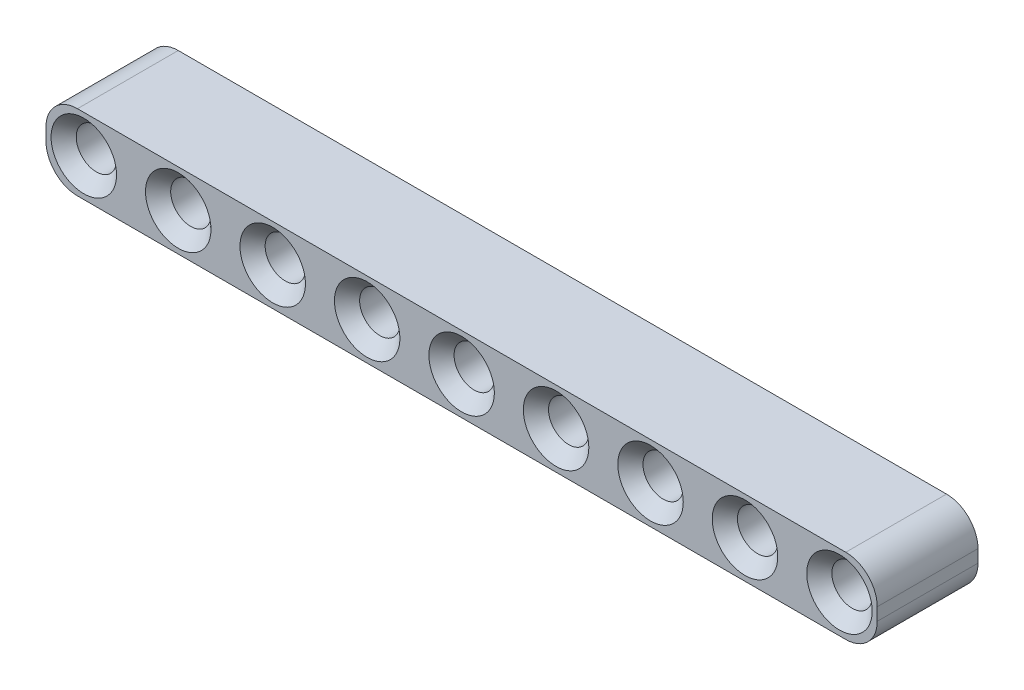
ISO-10303-21;
HEADER;
FILE_DESCRIPTION(('STEP AP214'),'2;1');
FILE_NAME('part.step','',(''),(''),'','','');
FILE_SCHEMA(('AUTOMOTIVE_DESIGN { 1 0 10303 214 1 1 1 1 }'));
ENDSEC;
DATA;
#1=APPLICATION_CONTEXT('core data for automotive mechanical design processes');
#2=APPLICATION_PROTOCOL_DEFINITION('international standard','automotive_design',2000,#1);
#3=PRODUCT_CONTEXT('',#1,'mechanical');
#4=PRODUCT('Part','Part','',(#3));
#5=PRODUCT_RELATED_PRODUCT_CATEGORY('part','',(#4));
#6=PRODUCT_DEFINITION_FORMATION('','',#4);
#7=PRODUCT_DEFINITION_CONTEXT('part definition',#1,'design');
#8=PRODUCT_DEFINITION('design','',#6,#7);
#9=PRODUCT_DEFINITION_SHAPE('','',#8);
#10=(LENGTH_UNIT() NAMED_UNIT(*) SI_UNIT(.MILLI.,.METRE.));
#11=(NAMED_UNIT(*) PLANE_ANGLE_UNIT() SI_UNIT($,.RADIAN.));
#12=(NAMED_UNIT(*) SI_UNIT($,.STERADIAN.) SOLID_ANGLE_UNIT());
#13=UNCERTAINTY_MEASURE_WITH_UNIT(LENGTH_MEASURE(1.E-05),#10,'distance_accuracy_value','');
#14=(GEOMETRIC_REPRESENTATION_CONTEXT(3) GLOBAL_UNCERTAINTY_ASSIGNED_CONTEXT((#13)) GLOBAL_UNIT_ASSIGNED_CONTEXT((#10,
#11,#12)) REPRESENTATION_CONTEXT('',''));
#15=CARTESIAN_POINT('',(0.,0.,0.));
#16=DIRECTION('',(0.,0.,1.));
#17=DIRECTION('',(1.,0.,0.));
#18=AXIS2_PLACEMENT_3D('',#15,#16,#17);
#19=CARTESIAN_POINT('',(60.5,-0.5,8.));
#20=DIRECTION('',(0.,0.,1.));
#21=DIRECTION('',(1.,0.,0.));
#22=AXIS2_PLACEMENT_3D('',#19,#20,#21);
#23=PLANE('',#22);
#24=CARTESIAN_POINT('',(60.,0.,8.));
#25=DIRECTION('',(0.,0.,1.));
#26=DIRECTION('',(1.,0.,0.));
#27=AXIS2_PLACEMENT_3D('',#24,#25,#26);
#28=CIRCLE('',#27,2.60000000000002);
#29=CARTESIAN_POINT('',(62.6,0.,8.));
#30=VERTEX_POINT('',#29);
#31=EDGE_CURVE('E216',#30,#30,#28,.F.);
#32=ORIENTED_EDGE('',*,*,#31,.T.);
#33=EDGE_LOOP('',(#32));
#34=FACE_BOUND('',#33,.T.);
#35=CARTESIAN_POINT('',(52.5,0.,8.));
#36=DIRECTION('',(0.,0.,1.));
#37=DIRECTION('',(1.,0.,0.));
#38=AXIS2_PLACEMENT_3D('',#35,#36,#37);
#39=CIRCLE('',#38,2.6);
#40=CARTESIAN_POINT('',(55.1,0.,8.));
#41=VERTEX_POINT('',#40);
#42=EDGE_CURVE('E213',#41,#41,#39,.F.);
#43=ORIENTED_EDGE('',*,*,#42,.T.);
#44=EDGE_LOOP('',(#43));
#45=FACE_BOUND('',#44,.T.);
#46=CARTESIAN_POINT('',(45.,0.,8.));
#47=DIRECTION('',(0.,0.,1.));
#48=DIRECTION('',(1.,0.,0.));
#49=AXIS2_PLACEMENT_3D('',#46,#47,#48);
#50=CIRCLE('',#49,2.6);
#51=CARTESIAN_POINT('',(47.6,0.,8.));
#52=VERTEX_POINT('',#51);
#53=EDGE_CURVE('E210',#52,#52,#50,.F.);
#54=ORIENTED_EDGE('',*,*,#53,.T.);
#55=EDGE_LOOP('',(#54));
#56=FACE_BOUND('',#55,.T.);
#57=CARTESIAN_POINT('',(37.5,0.,8.));
#58=DIRECTION('',(0.,0.,1.));
#59=DIRECTION('',(1.,0.,0.));
#60=AXIS2_PLACEMENT_3D('',#57,#58,#59);
#61=CIRCLE('',#60,2.6);
#62=CARTESIAN_POINT('',(40.1,0.,8.));
#63=VERTEX_POINT('',#62);
#64=EDGE_CURVE('E207',#63,#63,#61,.F.);
#65=ORIENTED_EDGE('',*,*,#64,.T.);
#66=EDGE_LOOP('',(#65));
#67=FACE_BOUND('',#66,.T.);
#68=CARTESIAN_POINT('',(30.,0.,8.));
#69=DIRECTION('',(0.,0.,1.));
#70=DIRECTION('',(1.,0.,0.));
#71=AXIS2_PLACEMENT_3D('',#68,#69,#70);
#72=CIRCLE('',#71,2.6);
#73=CARTESIAN_POINT('',(32.6,0.,8.));
#74=VERTEX_POINT('',#73);
#75=EDGE_CURVE('E204',#74,#74,#72,.F.);
#76=ORIENTED_EDGE('',*,*,#75,.T.);
#77=EDGE_LOOP('',(#76));
#78=FACE_BOUND('',#77,.T.);
#79=CARTESIAN_POINT('',(22.5,0.,8.));
#80=DIRECTION('',(0.,0.,1.));
#81=DIRECTION('',(1.,0.,0.));
#82=AXIS2_PLACEMENT_3D('',#79,#80,#81);
#83=CIRCLE('',#82,2.6);
#84=CARTESIAN_POINT('',(25.1,0.,8.));
#85=VERTEX_POINT('',#84);
#86=EDGE_CURVE('E201',#85,#85,#83,.F.);
#87=ORIENTED_EDGE('',*,*,#86,.T.);
#88=EDGE_LOOP('',(#87));
#89=FACE_BOUND('',#88,.T.);
#90=CARTESIAN_POINT('',(15.,0.,8.));
#91=DIRECTION('',(0.,0.,1.));
#92=DIRECTION('',(1.,0.,0.));
#93=AXIS2_PLACEMENT_3D('',#90,#91,#92);
#94=CIRCLE('',#93,2.6);
#95=CARTESIAN_POINT('',(17.6,0.,8.));
#96=VERTEX_POINT('',#95);
#97=EDGE_CURVE('E198',#96,#96,#94,.F.);
#98=ORIENTED_EDGE('',*,*,#97,.T.);
#99=EDGE_LOOP('',(#98));
#100=FACE_BOUND('',#99,.T.);
#101=CARTESIAN_POINT('',(7.5,0.,8.));
#102=DIRECTION('',(0.,0.,1.));
#103=DIRECTION('',(1.,0.,0.));
#104=AXIS2_PLACEMENT_3D('',#101,#102,#103);
#105=CIRCLE('',#104,2.60000000000002);
#106=CARTESIAN_POINT('',(10.1,0.,8.));
#107=VERTEX_POINT('',#106);
#108=EDGE_CURVE('E195',#107,#107,#105,.F.);
#109=ORIENTED_EDGE('',*,*,#108,.T.);
#110=EDGE_LOOP('',(#109));
#111=FACE_BOUND('',#110,.T.);
#112=CARTESIAN_POINT('',(0.,0.,8.));
#113=DIRECTION('',(0.,0.,1.));
#114=DIRECTION('',(1.,0.,0.));
#115=AXIS2_PLACEMENT_3D('',#112,#113,#114);
#116=CIRCLE('',#115,2.6);
#117=CARTESIAN_POINT('',(2.6,0.,8.));
#118=VERTEX_POINT('',#117);
#119=EDGE_CURVE('E192',#118,#118,#116,.F.);
#120=ORIENTED_EDGE('',*,*,#119,.T.);
#121=EDGE_LOOP('',(#120));
#122=FACE_BOUND('',#121,.T.);
#123=CARTESIAN_POINT('',(60.5,-0.5,8.));
#124=DIRECTION('',(0.,0.,1.));
#125=DIRECTION('',(1.,0.,0.));
#126=AXIS2_PLACEMENT_3D('',#123,#124,#125);
#127=CIRCLE('',#126,2.5);
#128=CARTESIAN_POINT('',(60.5,-3.,8.));
#129=VERTEX_POINT('',#128);
#130=CARTESIAN_POINT('',(63.,-0.5,8.));
#131=VERTEX_POINT('',#130);
#132=EDGE_CURVE('E144',#129,#131,#127,.T.);
#133=ORIENTED_EDGE('',*,*,#132,.T.);
#134=DIRECTION('',(0.,1.,0.));
#135=VECTOR('',#134,1.);
#136=CARTESIAN_POINT('',(63.,0.5,8.));
#137=LINE('',#136,#135);
#138=CARTESIAN_POINT('',(63.,0.5,8.));
#139=VERTEX_POINT('',#138);
#140=EDGE_CURVE('E94',#131,#139,#137,.T.);
#141=ORIENTED_EDGE('',*,*,#140,.T.);
#142=CARTESIAN_POINT('',(60.5,0.5,8.));
#143=DIRECTION('',(0.,0.,1.));
#144=DIRECTION('',(-1.,0.,0.));
#145=AXIS2_PLACEMENT_3D('',#142,#143,#144);
#146=CIRCLE('',#145,2.5);
#147=CARTESIAN_POINT('',(60.5,3.,8.));
#148=VERTEX_POINT('',#147);
#149=EDGE_CURVE('E446',#139,#148,#146,.T.);
#150=ORIENTED_EDGE('',*,*,#149,.T.);
#151=DIRECTION('',(-1.,0.,0.));
#152=VECTOR('',#151,1.);
#153=CARTESIAN_POINT('',(-0.5,3.,8.));
#154=LINE('',#153,#152);
#155=CARTESIAN_POINT('',(-0.5,3.,8.));
#156=VERTEX_POINT('',#155);
#157=EDGE_CURVE('E450',#148,#156,#154,.T.);
#158=ORIENTED_EDGE('',*,*,#157,.T.);
#159=CARTESIAN_POINT('',(-0.5,0.5,8.));
#160=DIRECTION('',(0.,0.,1.));
#161=DIRECTION('',(1.,0.,0.));
#162=AXIS2_PLACEMENT_3D('',#159,#160,#161);
#163=CIRCLE('',#162,2.5);
#164=CARTESIAN_POINT('',(-3.,0.5,8.));
#165=VERTEX_POINT('',#164);
#166=EDGE_CURVE('E112',#156,#165,#163,.T.);
#167=ORIENTED_EDGE('',*,*,#166,.T.);
#168=DIRECTION('',(0.,-1.,0.));
#169=VECTOR('',#168,1.);
#170=CARTESIAN_POINT('',(-3.,0.5,8.));
#171=LINE('',#170,#169);
#172=CARTESIAN_POINT('',(-3.,-0.5,8.));
#173=VERTEX_POINT('',#172);
#174=EDGE_CURVE('E107',#165,#173,#171,.T.);
#175=ORIENTED_EDGE('',*,*,#174,.T.);
#176=CARTESIAN_POINT('',(-0.5,-0.5,8.));
#177=DIRECTION('',(0.,0.,1.));
#178=DIRECTION('',(1.,0.,0.));
#179=AXIS2_PLACEMENT_3D('',#176,#177,#178);
#180=CIRCLE('',#179,2.5);
#181=CARTESIAN_POINT('',(-0.5,-3.,8.));
#182=VERTEX_POINT('',#181);
#183=EDGE_CURVE('E110',#173,#182,#180,.T.);
#184=ORIENTED_EDGE('',*,*,#183,.T.);
#185=DIRECTION('',(1.,0.,0.));
#186=VECTOR('',#185,1.);
#187=CARTESIAN_POINT('',(-0.5,-3.,8.));
#188=LINE('',#187,#186);
#189=EDGE_CURVE('E50',#182,#129,#188,.T.);
#190=ORIENTED_EDGE('',*,*,#189,.T.);
#191=EDGE_LOOP('',(#133,#141,#150,#158,#167,#175,#184,#190));
#192=FACE_BOUND('',#191,.T.);
#193=ADVANCED_FACE('F33',(#34,#45,#56,#67,#78,#89,#100,#111,#122,#192),#23,.T.);
#194=CARTESIAN_POINT('',(60.5,-0.5,0.));
#195=DIRECTION('',(0.,0.,1.));
#196=DIRECTION('',(1.,0.,0.));
#197=AXIS2_PLACEMENT_3D('',#194,#195,#196);
#198=PLANE('',#197);
#199=CARTESIAN_POINT('',(60.,0.,0.));
#200=DIRECTION('',(0.,0.,1.));
#201=DIRECTION('',(1.,0.,0.));
#202=AXIS2_PLACEMENT_3D('',#199,#200,#201);
#203=CIRCLE('',#202,2.6);
#204=CARTESIAN_POINT('',(62.6,0.,0.));
#205=VERTEX_POINT('',#204);
#206=EDGE_CURVE('E183',#205,#205,#203,.T.);
#207=ORIENTED_EDGE('',*,*,#206,.T.);
#208=EDGE_LOOP('',(#207));
#209=FACE_BOUND('',#208,.T.);
#210=CARTESIAN_POINT('',(52.5,0.,0.));
#211=DIRECTION('',(0.,0.,1.));
#212=DIRECTION('',(1.,0.,0.));
#213=AXIS2_PLACEMENT_3D('',#210,#211,#212);
#214=CIRCLE('',#213,2.6);
#215=CARTESIAN_POINT('',(55.1,0.,0.));
#216=VERTEX_POINT('',#215);
#217=EDGE_CURVE('E180',#216,#216,#214,.T.);
#218=ORIENTED_EDGE('',*,*,#217,.T.);
#219=EDGE_LOOP('',(#218));
#220=FACE_BOUND('',#219,.T.);
#221=CARTESIAN_POINT('',(45.,0.,0.));
#222=DIRECTION('',(0.,0.,1.));
#223=DIRECTION('',(1.,0.,0.));
#224=AXIS2_PLACEMENT_3D('',#221,#222,#223);
#225=CIRCLE('',#224,2.6);
#226=CARTESIAN_POINT('',(47.6,0.,0.));
#227=VERTEX_POINT('',#226);
#228=EDGE_CURVE('E177',#227,#227,#225,.T.);
#229=ORIENTED_EDGE('',*,*,#228,.T.);
#230=EDGE_LOOP('',(#229));
#231=FACE_BOUND('',#230,.T.);
#232=CARTESIAN_POINT('',(37.5,0.,0.));
#233=DIRECTION('',(0.,0.,1.));
#234=DIRECTION('',(1.,0.,0.));
#235=AXIS2_PLACEMENT_3D('',#232,#233,#234);
#236=CIRCLE('',#235,2.6);
#237=CARTESIAN_POINT('',(40.1,0.,0.));
#238=VERTEX_POINT('',#237);
#239=EDGE_CURVE('E174',#238,#238,#236,.T.);
#240=ORIENTED_EDGE('',*,*,#239,.T.);
#241=EDGE_LOOP('',(#240));
#242=FACE_BOUND('',#241,.T.);
#243=CARTESIAN_POINT('',(30.,0.,0.));
#244=DIRECTION('',(0.,0.,1.));
#245=DIRECTION('',(1.,0.,0.));
#246=AXIS2_PLACEMENT_3D('',#243,#244,#245);
#247=CIRCLE('',#246,2.6);
#248=CARTESIAN_POINT('',(32.6,0.,0.));
#249=VERTEX_POINT('',#248);
#250=EDGE_CURVE('E171',#249,#249,#247,.T.);
#251=ORIENTED_EDGE('',*,*,#250,.T.);
#252=EDGE_LOOP('',(#251));
#253=FACE_BOUND('',#252,.T.);
#254=CARTESIAN_POINT('',(22.5,0.,0.));
#255=DIRECTION('',(0.,0.,1.));
#256=DIRECTION('',(1.,0.,0.));
#257=AXIS2_PLACEMENT_3D('',#254,#255,#256);
#258=CIRCLE('',#257,2.6);
#259=CARTESIAN_POINT('',(25.1,0.,0.));
#260=VERTEX_POINT('',#259);
#261=EDGE_CURVE('E168',#260,#260,#258,.T.);
#262=ORIENTED_EDGE('',*,*,#261,.T.);
#263=EDGE_LOOP('',(#262));
#264=FACE_BOUND('',#263,.T.);
#265=CARTESIAN_POINT('',(15.,0.,0.));
#266=DIRECTION('',(0.,0.,1.));
#267=DIRECTION('',(1.,0.,0.));
#268=AXIS2_PLACEMENT_3D('',#265,#266,#267);
#269=CIRCLE('',#268,2.6);
#270=CARTESIAN_POINT('',(17.6,0.,0.));
#271=VERTEX_POINT('',#270);
#272=EDGE_CURVE('E165',#271,#271,#269,.T.);
#273=ORIENTED_EDGE('',*,*,#272,.T.);
#274=EDGE_LOOP('',(#273));
#275=FACE_BOUND('',#274,.T.);
#276=CARTESIAN_POINT('',(7.5,0.,0.));
#277=DIRECTION('',(0.,0.,1.));
#278=DIRECTION('',(1.,0.,0.));
#279=AXIS2_PLACEMENT_3D('',#276,#277,#278);
#280=CIRCLE('',#279,2.59999999999999);
#281=CARTESIAN_POINT('',(10.1,0.,0.));
#282=VERTEX_POINT('',#281);
#283=EDGE_CURVE('E162',#282,#282,#280,.T.);
#284=ORIENTED_EDGE('',*,*,#283,.T.);
#285=EDGE_LOOP('',(#284));
#286=FACE_BOUND('',#285,.T.);
#287=CARTESIAN_POINT('',(0.,0.,0.));
#288=DIRECTION('',(0.,0.,1.));
#289=DIRECTION('',(1.,0.,0.));
#290=AXIS2_PLACEMENT_3D('',#287,#288,#289);
#291=CIRCLE('',#290,2.59999999999999);
#292=CARTESIAN_POINT('',(2.59999999999999,0.,0.));
#293=VERTEX_POINT('',#292);
#294=EDGE_CURVE('E159',#293,#293,#291,.T.);
#295=ORIENTED_EDGE('',*,*,#294,.T.);
#296=EDGE_LOOP('',(#295));
#297=FACE_BOUND('',#296,.T.);
#298=CARTESIAN_POINT('',(60.5,-0.5,0.));
#299=DIRECTION('',(0.,0.,1.));
#300=DIRECTION('',(1.,0.,0.));
#301=AXIS2_PLACEMENT_3D('',#298,#299,#300);
#302=CIRCLE('',#301,2.5);
#303=CARTESIAN_POINT('',(60.5,-3.,0.));
#304=VERTEX_POINT('',#303);
#305=CARTESIAN_POINT('',(63.,-0.5,0.));
#306=VERTEX_POINT('',#305);
#307=EDGE_CURVE('E130',#304,#306,#302,.T.);
#308=ORIENTED_EDGE('',*,*,#307,.F.);
#309=DIRECTION('',(1.,0.,0.));
#310=VECTOR('',#309,1.);
#311=CARTESIAN_POINT('',(-0.5,-3.,0.));
#312=LINE('',#311,#310);
#313=CARTESIAN_POINT('',(-0.5,-3.,0.));
#314=VERTEX_POINT('',#313);
#315=EDGE_CURVE('E85',#314,#304,#312,.T.);
#316=ORIENTED_EDGE('',*,*,#315,.F.);
#317=CARTESIAN_POINT('',(-0.5,-0.5,0.));
#318=DIRECTION('',(0.,0.,1.));
#319=DIRECTION('',(1.,0.,0.));
#320=AXIS2_PLACEMENT_3D('',#317,#318,#319);
#321=CIRCLE('',#320,2.5);
#322=CARTESIAN_POINT('',(-3.,-0.5,0.));
#323=VERTEX_POINT('',#322);
#324=EDGE_CURVE('E79',#323,#314,#321,.T.);
#325=ORIENTED_EDGE('',*,*,#324,.F.);
#326=DIRECTION('',(0.,-1.,0.));
#327=VECTOR('',#326,1.);
#328=CARTESIAN_POINT('',(-3.,0.5,0.));
#329=LINE('',#328,#327);
#330=CARTESIAN_POINT('',(-3.,0.5,0.));
#331=VERTEX_POINT('',#330);
#332=EDGE_CURVE('E120',#331,#323,#329,.T.);
#333=ORIENTED_EDGE('',*,*,#332,.F.);
#334=CARTESIAN_POINT('',(-0.5,0.5,0.));
#335=DIRECTION('',(0.,0.,1.));
#336=DIRECTION('',(1.,0.,0.));
#337=AXIS2_PLACEMENT_3D('',#334,#335,#336);
#338=CIRCLE('',#337,2.5);
#339=CARTESIAN_POINT('',(-0.5,3.,0.));
#340=VERTEX_POINT('',#339);
#341=EDGE_CURVE('E139',#340,#331,#338,.T.);
#342=ORIENTED_EDGE('',*,*,#341,.F.);
#343=DIRECTION('',(-1.,0.,0.));
#344=VECTOR('',#343,1.);
#345=CARTESIAN_POINT('',(-0.5,3.,0.));
#346=LINE('',#345,#344);
#347=CARTESIAN_POINT('',(60.5,3.,0.));
#348=VERTEX_POINT('',#347);
#349=EDGE_CURVE('E137',#348,#340,#346,.T.);
#350=ORIENTED_EDGE('',*,*,#349,.F.);
#351=CARTESIAN_POINT('',(60.5,0.5,0.));
#352=DIRECTION('',(0.,0.,1.));
#353=DIRECTION('',(-1.,0.,0.));
#354=AXIS2_PLACEMENT_3D('',#351,#352,#353);
#355=CIRCLE('',#354,2.5);
#356=CARTESIAN_POINT('',(63.,0.5,0.));
#357=VERTEX_POINT('',#356);
#358=EDGE_CURVE('E135',#357,#348,#355,.T.);
#359=ORIENTED_EDGE('',*,*,#358,.F.);
#360=DIRECTION('',(0.,1.,0.));
#361=VECTOR('',#360,1.);
#362=CARTESIAN_POINT('',(63.,0.5,0.));
#363=LINE('',#362,#361);
#364=EDGE_CURVE('E133',#306,#357,#363,.T.);
#365=ORIENTED_EDGE('',*,*,#364,.F.);
#366=EDGE_LOOP('',(#308,#316,#325,#333,#342,#350,#359,#365));
#367=FACE_BOUND('',#366,.T.);
#368=ADVANCED_FACE('F275',(#209,#220,#231,#242,#253,#264,#275,#286,#297,#367),#198,.F.);
#369=CARTESIAN_POINT('',(60.5,-0.5,8.));
#370=DIRECTION('',(0.,0.,-1.));
#371=DIRECTION('',(-1.,0.,0.));
#372=AXIS2_PLACEMENT_3D('',#369,#370,#371);
#373=CYLINDRICAL_SURFACE('',#372,2.5);
#374=ORIENTED_EDGE('',*,*,#307,.T.);
#375=DIRECTION('',(0.,0.,-1.));
#376=VECTOR('',#375,1.);
#377=CARTESIAN_POINT('',(63.,-0.5,8.));
#378=LINE('',#377,#376);
#379=EDGE_CURVE('E157',#131,#306,#378,.T.);
#380=ORIENTED_EDGE('',*,*,#379,.F.);
#381=ORIENTED_EDGE('',*,*,#132,.F.);
#382=DIRECTION('',(0.,0.,-1.));
#383=VECTOR('',#382,1.);
#384=CARTESIAN_POINT('',(60.5,-3.,8.));
#385=LINE('',#384,#383);
#386=EDGE_CURVE('E126',#129,#304,#385,.T.);
#387=ORIENTED_EDGE('',*,*,#386,.T.);
#388=EDGE_LOOP('',(#374,#380,#381,#387));
#389=FACE_BOUND('',#388,.T.);
#390=ADVANCED_FACE('F281',(#389),#373,.T.);
#391=CARTESIAN_POINT('',(63.,0.5,8.));
#392=DIRECTION('',(-1.,0.,0.));
#393=DIRECTION('',(0.,0.,1.));
#394=AXIS2_PLACEMENT_3D('',#391,#392,#393);
#395=PLANE('',#394);
#396=ORIENTED_EDGE('',*,*,#364,.T.);
#397=DIRECTION('',(0.,0.,-1.));
#398=VECTOR('',#397,1.);
#399=CARTESIAN_POINT('',(63.,0.5,8.));
#400=LINE('',#399,#398);
#401=EDGE_CURVE('E154',#139,#357,#400,.T.);
#402=ORIENTED_EDGE('',*,*,#401,.F.);
#403=ORIENTED_EDGE('',*,*,#140,.F.);
#404=ORIENTED_EDGE('',*,*,#379,.T.);
#405=EDGE_LOOP('',(#396,#402,#403,#404));
#406=FACE_BOUND('',#405,.T.);
#407=ADVANCED_FACE('F306',(#406),#395,.F.);
#408=CARTESIAN_POINT('',(60.5,0.5,8.));
#409=DIRECTION('',(0.,0.,-1.));
#410=DIRECTION('',(-1.,0.,0.));
#411=AXIS2_PLACEMENT_3D('',#408,#409,#410);
#412=CYLINDRICAL_SURFACE('',#411,2.5);
#413=ORIENTED_EDGE('',*,*,#358,.T.);
#414=DIRECTION('',(0.,0.,-1.));
#415=VECTOR('',#414,1.);
#416=CARTESIAN_POINT('',(60.5,3.,8.));
#417=LINE('',#416,#415);
#418=EDGE_CURVE('E151',#148,#348,#417,.T.);
#419=ORIENTED_EDGE('',*,*,#418,.F.);
#420=ORIENTED_EDGE('',*,*,#149,.F.);
#421=ORIENTED_EDGE('',*,*,#401,.T.);
#422=EDGE_LOOP('',(#413,#419,#420,#421));
#423=FACE_BOUND('',#422,.T.);
#424=ADVANCED_FACE('F302',(#423),#412,.T.);
#425=CARTESIAN_POINT('',(-0.5,3.,8.));
#426=DIRECTION('',(0.,-1.,0.));
#427=DIRECTION('',(1.,0.,0.));
#428=AXIS2_PLACEMENT_3D('',#425,#426,#427);
#429=PLANE('',#428);
#430=ORIENTED_EDGE('',*,*,#349,.T.);
#431=DIRECTION('',(0.,0.,-1.));
#432=VECTOR('',#431,1.);
#433=CARTESIAN_POINT('',(-0.5,3.,8.));
#434=LINE('',#433,#432);
#435=EDGE_CURVE('E148',#156,#340,#434,.T.);
#436=ORIENTED_EDGE('',*,*,#435,.F.);
#437=ORIENTED_EDGE('',*,*,#157,.F.);
#438=ORIENTED_EDGE('',*,*,#418,.T.);
#439=EDGE_LOOP('',(#430,#436,#437,#438));
#440=FACE_BOUND('',#439,.T.);
#441=ADVANCED_FACE('F298',(#440),#429,.F.);
#442=CARTESIAN_POINT('',(-0.5,0.5,8.));
#443=DIRECTION('',(0.,0.,-1.));
#444=DIRECTION('',(-1.,0.,0.));
#445=AXIS2_PLACEMENT_3D('',#442,#443,#444);
#446=CYLINDRICAL_SURFACE('',#445,2.5);
#447=ORIENTED_EDGE('',*,*,#341,.T.);
#448=DIRECTION('',(0.,0.,-1.));
#449=VECTOR('',#448,1.);
#450=CARTESIAN_POINT('',(-3.,0.5,8.));
#451=LINE('',#450,#449);
#452=EDGE_CURVE('E121',#165,#331,#451,.T.);
#453=ORIENTED_EDGE('',*,*,#452,.F.);
#454=ORIENTED_EDGE('',*,*,#166,.F.);
#455=ORIENTED_EDGE('',*,*,#435,.T.);
#456=EDGE_LOOP('',(#447,#453,#454,#455));
#457=FACE_BOUND('',#456,.T.);
#458=ADVANCED_FACE('F295',(#457),#446,.T.);
#459=CARTESIAN_POINT('',(-3.,0.5,8.));
#460=DIRECTION('',(1.,0.,0.));
#461=DIRECTION('',(0.,0.,-1.));
#462=AXIS2_PLACEMENT_3D('',#459,#460,#461);
#463=PLANE('',#462);
#464=ORIENTED_EDGE('',*,*,#332,.T.);
#465=DIRECTION('',(0.,0.,-1.));
#466=VECTOR('',#465,1.);
#467=CARTESIAN_POINT('',(-3.,-0.5,8.));
#468=LINE('',#467,#466);
#469=EDGE_CURVE('E117',#173,#323,#468,.T.);
#470=ORIENTED_EDGE('',*,*,#469,.F.);
#471=ORIENTED_EDGE('',*,*,#174,.F.);
#472=ORIENTED_EDGE('',*,*,#452,.T.);
#473=EDGE_LOOP('',(#464,#470,#471,#472));
#474=FACE_BOUND('',#473,.T.);
#475=ADVANCED_FACE('F118',(#474),#463,.F.);
#476=CARTESIAN_POINT('',(-0.5,-0.5,8.));
#477=DIRECTION('',(0.,0.,-1.));
#478=DIRECTION('',(-1.,0.,0.));
#479=AXIS2_PLACEMENT_3D('',#476,#477,#478);
#480=CYLINDRICAL_SURFACE('',#479,2.5);
#481=ORIENTED_EDGE('',*,*,#324,.T.);
#482=DIRECTION('',(0.,0.,-1.));
#483=VECTOR('',#482,1.);
#484=CARTESIAN_POINT('',(-0.5,-3.,8.));
#485=LINE('',#484,#483);
#486=EDGE_CURVE('E122',#182,#314,#485,.T.);
#487=ORIENTED_EDGE('',*,*,#486,.F.);
#488=ORIENTED_EDGE('',*,*,#183,.F.);
#489=ORIENTED_EDGE('',*,*,#469,.T.);
#490=EDGE_LOOP('',(#481,#487,#488,#489));
#491=FACE_BOUND('',#490,.T.);
#492=ADVANCED_FACE('F124',(#491),#480,.T.);
#493=CARTESIAN_POINT('',(-0.5,-3.,8.));
#494=DIRECTION('',(0.,1.,0.));
#495=DIRECTION('',(-1.,0.,0.));
#496=AXIS2_PLACEMENT_3D('',#493,#494,#495);
#497=PLANE('',#496);
#498=ORIENTED_EDGE('',*,*,#315,.T.);
#499=ORIENTED_EDGE('',*,*,#386,.F.);
#500=ORIENTED_EDGE('',*,*,#189,.F.);
#501=ORIENTED_EDGE('',*,*,#486,.T.);
#502=EDGE_LOOP('',(#498,#499,#500,#501));
#503=FACE_BOUND('',#502,.T.);
#504=ADVANCED_FACE('F288',(#503),#497,.F.);
#505=CARTESIAN_POINT('',(0.,0.,8.));
#506=DIRECTION('',(0.,0.,-1.));
#507=DIRECTION('',(-1.,0.,0.));
#508=AXIS2_PLACEMENT_3D('',#505,#506,#507);
#509=CYLINDRICAL_SURFACE('',#508,1.6);
#510=CARTESIAN_POINT('',(0.,0.,0.999999999999999));
#511=DIRECTION('',(0.,0.,1.));
#512=DIRECTION('',(1.,0.,0.));
#513=AXIS2_PLACEMENT_3D('',#510,#511,#512);
#514=CIRCLE('',#513,1.6);
#515=CARTESIAN_POINT('',(1.6,0.,0.999999999999999));
#516=VERTEX_POINT('',#515);
#517=EDGE_CURVE('E11',#516,#516,#514,.F.);
#518=ORIENTED_EDGE('',*,*,#517,.T.);
#519=EDGE_LOOP('',(#518));
#520=FACE_BOUND('',#519,.T.);
#521=CARTESIAN_POINT('',(0.,0.,7.));
#522=DIRECTION('',(0.,0.,1.));
#523=DIRECTION('',(1.,0.,0.));
#524=AXIS2_PLACEMENT_3D('',#521,#522,#523);
#525=CIRCLE('',#524,1.6);
#526=CARTESIAN_POINT('',(1.6,0.,7.));
#527=VERTEX_POINT('',#526);
#528=EDGE_CURVE('E42',#527,#527,#525,.T.);
#529=ORIENTED_EDGE('',*,*,#528,.T.);
#530=EDGE_LOOP('',(#529));
#531=FACE_BOUND('',#530,.T.);
#532=ADVANCED_FACE('F263',(#520,#531),#509,.F.);
#533=CARTESIAN_POINT('',(7.5,0.,8.));
#534=DIRECTION('',(0.,0.,-1.));
#535=DIRECTION('',(-1.,0.,0.));
#536=AXIS2_PLACEMENT_3D('',#533,#534,#535);
#537=CYLINDRICAL_SURFACE('',#536,1.6);
#538=CARTESIAN_POINT('',(7.5,0.,0.999999999999997));
#539=DIRECTION('',(0.,0.,1.));
#540=DIRECTION('',(1.,0.,0.));
#541=AXIS2_PLACEMENT_3D('',#538,#539,#540);
#542=CIRCLE('',#541,1.6);
#543=CARTESIAN_POINT('',(9.1,0.,0.999999999999997));
#544=VERTEX_POINT('',#543);
#545=EDGE_CURVE('E258',#544,#544,#542,.F.);
#546=ORIENTED_EDGE('',*,*,#545,.T.);
#547=EDGE_LOOP('',(#546));
#548=FACE_BOUND('',#547,.T.);
#549=CARTESIAN_POINT('',(7.5,0.,6.99999999999998));
#550=DIRECTION('',(0.,0.,1.));
#551=DIRECTION('',(1.,0.,0.));
#552=AXIS2_PLACEMENT_3D('',#549,#550,#551);
#553=CIRCLE('',#552,1.6);
#554=CARTESIAN_POINT('',(9.1,0.,6.99999999999998));
#555=VERTEX_POINT('',#554);
#556=EDGE_CURVE('E255',#555,#555,#553,.T.);
#557=ORIENTED_EDGE('',*,*,#556,.T.);
#558=EDGE_LOOP('',(#557));
#559=FACE_BOUND('',#558,.T.);
#560=ADVANCED_FACE('F382',(#548,#559),#537,.F.);
#561=CARTESIAN_POINT('',(15.,0.,8.));
#562=DIRECTION('',(0.,0.,-1.));
#563=DIRECTION('',(-1.,0.,0.));
#564=AXIS2_PLACEMENT_3D('',#561,#562,#563);
#565=CYLINDRICAL_SURFACE('',#564,1.6);
#566=CARTESIAN_POINT('',(15.,0.,1.));
#567=DIRECTION('',(0.,0.,1.));
#568=DIRECTION('',(1.,0.,0.));
#569=AXIS2_PLACEMENT_3D('',#566,#567,#568);
#570=CIRCLE('',#569,1.6);
#571=CARTESIAN_POINT('',(16.6,0.,1.));
#572=VERTEX_POINT('',#571);
#573=EDGE_CURVE('E252',#572,#572,#570,.F.);
#574=ORIENTED_EDGE('',*,*,#573,.T.);
#575=EDGE_LOOP('',(#574));
#576=FACE_BOUND('',#575,.T.);
#577=CARTESIAN_POINT('',(15.,0.,7.00000000000001));
#578=DIRECTION('',(0.,0.,1.));
#579=DIRECTION('',(1.,0.,0.));
#580=AXIS2_PLACEMENT_3D('',#577,#578,#579);
#581=CIRCLE('',#580,1.6);
#582=CARTESIAN_POINT('',(16.6,0.,7.00000000000001));
#583=VERTEX_POINT('',#582);
#584=EDGE_CURVE('E249',#583,#583,#581,.T.);
#585=ORIENTED_EDGE('',*,*,#584,.T.);
#586=EDGE_LOOP('',(#585));
#587=FACE_BOUND('',#586,.T.);
#588=ADVANCED_FACE('F384',(#576,#587),#565,.F.);
#589=CARTESIAN_POINT('',(22.5,0.,8.));
#590=DIRECTION('',(0.,0.,-1.));
#591=DIRECTION('',(-1.,0.,0.));
#592=AXIS2_PLACEMENT_3D('',#589,#590,#591);
#593=CYLINDRICAL_SURFACE('',#592,1.6);
#594=CARTESIAN_POINT('',(22.5,0.,1.));
#595=DIRECTION('',(0.,0.,1.));
#596=DIRECTION('',(1.,0.,0.));
#597=AXIS2_PLACEMENT_3D('',#594,#595,#596);
#598=CIRCLE('',#597,1.6);
#599=CARTESIAN_POINT('',(24.1,0.,1.));
#600=VERTEX_POINT('',#599);
#601=EDGE_CURVE('E246',#600,#600,#598,.F.);
#602=ORIENTED_EDGE('',*,*,#601,.T.);
#603=EDGE_LOOP('',(#602));
#604=FACE_BOUND('',#603,.T.);
#605=CARTESIAN_POINT('',(22.5,0.,7.00000000000001));
#606=DIRECTION('',(0.,0.,1.));
#607=DIRECTION('',(1.,0.,0.));
#608=AXIS2_PLACEMENT_3D('',#605,#606,#607);
#609=CIRCLE('',#608,1.6);
#610=CARTESIAN_POINT('',(24.1,0.,7.00000000000001));
#611=VERTEX_POINT('',#610);
#612=EDGE_CURVE('E243',#611,#611,#609,.T.);
#613=ORIENTED_EDGE('',*,*,#612,.T.);
#614=EDGE_LOOP('',(#613));
#615=FACE_BOUND('',#614,.T.);
#616=ADVANCED_FACE('F390',(#604,#615),#593,.F.);
#617=CARTESIAN_POINT('',(30.,0.,8.));
#618=DIRECTION('',(0.,0.,-1.));
#619=DIRECTION('',(-1.,0.,0.));
#620=AXIS2_PLACEMENT_3D('',#617,#618,#619);
#621=CYLINDRICAL_SURFACE('',#620,1.6);
#622=CARTESIAN_POINT('',(30.,0.,1.));
#623=DIRECTION('',(0.,0.,1.));
#624=DIRECTION('',(1.,0.,0.));
#625=AXIS2_PLACEMENT_3D('',#622,#623,#624);
#626=CIRCLE('',#625,1.6);
#627=CARTESIAN_POINT('',(31.6,0.,1.));
#628=VERTEX_POINT('',#627);
#629=EDGE_CURVE('E240',#628,#628,#626,.F.);
#630=ORIENTED_EDGE('',*,*,#629,.T.);
#631=EDGE_LOOP('',(#630));
#632=FACE_BOUND('',#631,.T.);
#633=CARTESIAN_POINT('',(30.,0.,7.00000000000001));
#634=DIRECTION('',(0.,0.,1.));
#635=DIRECTION('',(1.,0.,0.));
#636=AXIS2_PLACEMENT_3D('',#633,#634,#635);
#637=CIRCLE('',#636,1.6);
#638=CARTESIAN_POINT('',(31.6,0.,7.00000000000001));
#639=VERTEX_POINT('',#638);
#640=EDGE_CURVE('E237',#639,#639,#637,.T.);
#641=ORIENTED_EDGE('',*,*,#640,.T.);
#642=EDGE_LOOP('',(#641));
#643=FACE_BOUND('',#642,.T.);
#644=ADVANCED_FACE('F397',(#632,#643),#621,.F.);
#645=CARTESIAN_POINT('',(37.5,0.,8.));
#646=DIRECTION('',(0.,0.,-1.));
#647=DIRECTION('',(-1.,0.,0.));
#648=AXIS2_PLACEMENT_3D('',#645,#646,#647);
#649=CYLINDRICAL_SURFACE('',#648,1.6);
#650=CARTESIAN_POINT('',(37.5,0.,1.00000000000002));
#651=DIRECTION('',(0.,0.,1.));
#652=DIRECTION('',(1.,0.,0.));
#653=AXIS2_PLACEMENT_3D('',#650,#651,#652);
#654=CIRCLE('',#653,1.6);
#655=CARTESIAN_POINT('',(39.1,0.,1.00000000000002));
#656=VERTEX_POINT('',#655);
#657=EDGE_CURVE('E234',#656,#656,#654,.F.);
#658=ORIENTED_EDGE('',*,*,#657,.T.);
#659=EDGE_LOOP('',(#658));
#660=FACE_BOUND('',#659,.T.);
#661=CARTESIAN_POINT('',(37.5,0.,7.00000000000001));
#662=DIRECTION('',(0.,0.,1.));
#663=DIRECTION('',(1.,0.,0.));
#664=AXIS2_PLACEMENT_3D('',#661,#662,#663);
#665=CIRCLE('',#664,1.6);
#666=CARTESIAN_POINT('',(39.1,0.,7.00000000000001));
#667=VERTEX_POINT('',#666);
#668=EDGE_CURVE('E231',#667,#667,#665,.T.);
#669=ORIENTED_EDGE('',*,*,#668,.T.);
#670=EDGE_LOOP('',(#669));
#671=FACE_BOUND('',#670,.T.);
#672=ADVANCED_FACE('F401',(#660,#671),#649,.F.);
#673=CARTESIAN_POINT('',(45.,0.,8.));
#674=DIRECTION('',(0.,0.,-1.));
#675=DIRECTION('',(-1.,0.,0.));
#676=AXIS2_PLACEMENT_3D('',#673,#674,#675);
#677=CYLINDRICAL_SURFACE('',#676,1.6);
#678=CARTESIAN_POINT('',(45.,0.,1.00000000000002));
#679=DIRECTION('',(0.,0.,1.));
#680=DIRECTION('',(1.,0.,0.));
#681=AXIS2_PLACEMENT_3D('',#678,#679,#680);
#682=CIRCLE('',#681,1.6);
#683=CARTESIAN_POINT('',(46.6,0.,1.00000000000002));
#684=VERTEX_POINT('',#683);
#685=EDGE_CURVE('E228',#684,#684,#682,.F.);
#686=ORIENTED_EDGE('',*,*,#685,.T.);
#687=EDGE_LOOP('',(#686));
#688=FACE_BOUND('',#687,.T.);
#689=CARTESIAN_POINT('',(45.,0.,7.00000000000001));
#690=DIRECTION('',(0.,0.,1.));
#691=DIRECTION('',(1.,0.,0.));
#692=AXIS2_PLACEMENT_3D('',#689,#690,#691);
#693=CIRCLE('',#692,1.6);
#694=CARTESIAN_POINT('',(46.6,0.,7.00000000000001));
#695=VERTEX_POINT('',#694);
#696=EDGE_CURVE('E225',#695,#695,#693,.T.);
#697=ORIENTED_EDGE('',*,*,#696,.T.);
#698=EDGE_LOOP('',(#697));
#699=FACE_BOUND('',#698,.T.);
#700=ADVANCED_FACE('F405',(#688,#699),#677,.F.);
#701=CARTESIAN_POINT('',(52.5,0.,8.));
#702=DIRECTION('',(0.,0.,-1.));
#703=DIRECTION('',(-1.,0.,0.));
#704=AXIS2_PLACEMENT_3D('',#701,#702,#703);
#705=CYLINDRICAL_SURFACE('',#704,1.6);
#706=CARTESIAN_POINT('',(52.5,0.,1.00000000000002));
#707=DIRECTION('',(0.,0.,1.));
#708=DIRECTION('',(1.,0.,0.));
#709=AXIS2_PLACEMENT_3D('',#706,#707,#708);
#710=CIRCLE('',#709,1.6);
#711=CARTESIAN_POINT('',(54.1,0.,1.00000000000002));
#712=VERTEX_POINT('',#711);
#713=EDGE_CURVE('E222',#712,#712,#710,.F.);
#714=ORIENTED_EDGE('',*,*,#713,.T.);
#715=EDGE_LOOP('',(#714));
#716=FACE_BOUND('',#715,.T.);
#717=CARTESIAN_POINT('',(52.5,0.,7.00000000000001));
#718=DIRECTION('',(0.,0.,1.));
#719=DIRECTION('',(1.,0.,0.));
#720=AXIS2_PLACEMENT_3D('',#717,#718,#719);
#721=CIRCLE('',#720,1.6);
#722=CARTESIAN_POINT('',(54.1,0.,7.00000000000001));
#723=VERTEX_POINT('',#722);
#724=EDGE_CURVE('E219',#723,#723,#721,.T.);
#725=ORIENTED_EDGE('',*,*,#724,.T.);
#726=EDGE_LOOP('',(#725));
#727=FACE_BOUND('',#726,.T.);
#728=ADVANCED_FACE('F409',(#716,#727),#705,.F.);
#729=CARTESIAN_POINT('',(60.,0.,8.));
#730=DIRECTION('',(0.,0.,-1.));
#731=DIRECTION('',(-1.,0.,0.));
#732=AXIS2_PLACEMENT_3D('',#729,#730,#731);
#733=CYLINDRICAL_SURFACE('',#732,1.60000000000001);
#734=CARTESIAN_POINT('',(60.,0.,1.00000000000001));
#735=DIRECTION('',(0.,0.,1.));
#736=DIRECTION('',(1.,0.,0.));
#737=AXIS2_PLACEMENT_3D('',#734,#735,#736);
#738=CIRCLE('',#737,1.60000000000001);
#739=CARTESIAN_POINT('',(61.6,0.,1.00000000000001));
#740=VERTEX_POINT('',#739);
#741=EDGE_CURVE('E189',#740,#740,#738,.F.);
#742=ORIENTED_EDGE('',*,*,#741,.T.);
#743=EDGE_LOOP('',(#742));
#744=FACE_BOUND('',#743,.T.);
#745=CARTESIAN_POINT('',(60.,0.,6.99999999999998));
#746=DIRECTION('',(0.,0.,1.));
#747=DIRECTION('',(1.,0.,0.));
#748=AXIS2_PLACEMENT_3D('',#745,#746,#747);
#749=CIRCLE('',#748,1.60000000000001);
#750=CARTESIAN_POINT('',(61.6,0.,6.99999999999998));
#751=VERTEX_POINT('',#750);
#752=EDGE_CURVE('E186',#751,#751,#749,.T.);
#753=ORIENTED_EDGE('',*,*,#752,.T.);
#754=EDGE_LOOP('',(#753));
#755=FACE_BOUND('',#754,.T.);
#756=ADVANCED_FACE('F317',(#744,#755),#733,.F.);
#757=CARTESIAN_POINT('',(60.,0.,0.));
#758=DIRECTION('',(0.,0.,-1.));
#759=DIRECTION('',(-1.,0.,0.));
#760=AXIS2_PLACEMENT_3D('',#757,#758,#759);
#761=CONICAL_SURFACE('',#760,2.6,0.785398163397443);
#762=ORIENTED_EDGE('',*,*,#741,.F.);
#763=EDGE_LOOP('',(#762));
#764=FACE_BOUND('',#763,.T.);
#765=ORIENTED_EDGE('',*,*,#206,.F.);
#766=EDGE_LOOP('',(#765));
#767=FACE_BOUND('',#766,.T.);
#768=ADVANCED_FACE('F313',(#764,#767),#761,.F.);
#769=CARTESIAN_POINT('',(60.,0.,6.99999999999998));
#770=DIRECTION('',(0.,0.,1.));
#771=DIRECTION('',(1.,0.,0.));
#772=AXIS2_PLACEMENT_3D('',#769,#770,#771);
#773=CONICAL_SURFACE('',#772,1.60000000000001,0.785398163397446);
#774=ORIENTED_EDGE('',*,*,#31,.F.);
#775=EDGE_LOOP('',(#774));
#776=FACE_BOUND('',#775,.T.);
#777=ORIENTED_EDGE('',*,*,#752,.F.);
#778=EDGE_LOOP('',(#777));
#779=FACE_BOUND('',#778,.T.);
#780=ADVANCED_FACE('F316',(#776,#779),#773,.F.);
#781=CARTESIAN_POINT('',(52.5,0.,0.));
#782=DIRECTION('',(0.,0.,-1.));
#783=DIRECTION('',(-1.,0.,0.));
#784=AXIS2_PLACEMENT_3D('',#781,#782,#783);
#785=CONICAL_SURFACE('',#784,2.6,0.785398163397443);
#786=ORIENTED_EDGE('',*,*,#713,.F.);
#787=EDGE_LOOP('',(#786));
#788=FACE_BOUND('',#787,.T.);
#789=ORIENTED_EDGE('',*,*,#217,.F.);
#790=EDGE_LOOP('',(#789));
#791=FACE_BOUND('',#790,.T.);
#792=ADVANCED_FACE('F321',(#788,#791),#785,.F.);
#793=CARTESIAN_POINT('',(52.5,0.,7.00000000000001));
#794=DIRECTION('',(0.,0.,1.));
#795=DIRECTION('',(1.,0.,0.));
#796=AXIS2_PLACEMENT_3D('',#793,#794,#795);
#797=CONICAL_SURFACE('',#796,1.6,0.785398163397452);
#798=ORIENTED_EDGE('',*,*,#42,.F.);
#799=EDGE_LOOP('',(#798));
#800=FACE_BOUND('',#799,.T.);
#801=ORIENTED_EDGE('',*,*,#724,.F.);
#802=EDGE_LOOP('',(#801));
#803=FACE_BOUND('',#802,.T.);
#804=ADVANCED_FACE('F325',(#800,#803),#797,.F.);
#805=CARTESIAN_POINT('',(45.,0.,0.));
#806=DIRECTION('',(0.,0.,-1.));
#807=DIRECTION('',(-1.,0.,0.));
#808=AXIS2_PLACEMENT_3D('',#805,#806,#807);
#809=CONICAL_SURFACE('',#808,2.6,0.785398163397443);
#810=ORIENTED_EDGE('',*,*,#685,.F.);
#811=EDGE_LOOP('',(#810));
#812=FACE_BOUND('',#811,.T.);
#813=ORIENTED_EDGE('',*,*,#228,.F.);
#814=EDGE_LOOP('',(#813));
#815=FACE_BOUND('',#814,.T.);
#816=ADVANCED_FACE('F329',(#812,#815),#809,.F.);
#817=CARTESIAN_POINT('',(45.,0.,7.00000000000001));
#818=DIRECTION('',(0.,0.,1.));
#819=DIRECTION('',(1.,0.,0.));
#820=AXIS2_PLACEMENT_3D('',#817,#818,#819);
#821=CONICAL_SURFACE('',#820,1.6,0.785398163397452);
#822=ORIENTED_EDGE('',*,*,#53,.F.);
#823=EDGE_LOOP('',(#822));
#824=FACE_BOUND('',#823,.T.);
#825=ORIENTED_EDGE('',*,*,#696,.F.);
#826=EDGE_LOOP('',(#825));
#827=FACE_BOUND('',#826,.T.);
#828=ADVANCED_FACE('F333',(#824,#827),#821,.F.);
#829=CARTESIAN_POINT('',(37.5,0.,0.));
#830=DIRECTION('',(0.,0.,-1.));
#831=DIRECTION('',(-1.,0.,0.));
#832=AXIS2_PLACEMENT_3D('',#829,#830,#831);
#833=CONICAL_SURFACE('',#832,2.6,0.785398163397443);
#834=ORIENTED_EDGE('',*,*,#657,.F.);
#835=EDGE_LOOP('',(#834));
#836=FACE_BOUND('',#835,.T.);
#837=ORIENTED_EDGE('',*,*,#239,.F.);
#838=EDGE_LOOP('',(#837));
#839=FACE_BOUND('',#838,.T.);
#840=ADVANCED_FACE('F337',(#836,#839),#833,.F.);
#841=CARTESIAN_POINT('',(37.5,0.,7.00000000000001));
#842=DIRECTION('',(0.,0.,1.));
#843=DIRECTION('',(1.,0.,0.));
#844=AXIS2_PLACEMENT_3D('',#841,#842,#843);
#845=CONICAL_SURFACE('',#844,1.6,0.785398163397452);
#846=ORIENTED_EDGE('',*,*,#64,.F.);
#847=EDGE_LOOP('',(#846));
#848=FACE_BOUND('',#847,.T.);
#849=ORIENTED_EDGE('',*,*,#668,.F.);
#850=EDGE_LOOP('',(#849));
#851=FACE_BOUND('',#850,.T.);
#852=ADVANCED_FACE('F341',(#848,#851),#845,.F.);
#853=CARTESIAN_POINT('',(30.,0.,0.));
#854=DIRECTION('',(0.,0.,-1.));
#855=DIRECTION('',(-1.,0.,0.));
#856=AXIS2_PLACEMENT_3D('',#853,#854,#855);
#857=CONICAL_SURFACE('',#856,2.6,0.785398163397448);
#858=ORIENTED_EDGE('',*,*,#629,.F.);
#859=EDGE_LOOP('',(#858));
#860=FACE_BOUND('',#859,.T.);
#861=ORIENTED_EDGE('',*,*,#250,.F.);
#862=EDGE_LOOP('',(#861));
#863=FACE_BOUND('',#862,.T.);
#864=ADVANCED_FACE('F345',(#860,#863),#857,.F.);
#865=CARTESIAN_POINT('',(30.,0.,7.00000000000001));
#866=DIRECTION('',(0.,0.,1.));
#867=DIRECTION('',(1.,0.,0.));
#868=AXIS2_PLACEMENT_3D('',#865,#866,#867);
#869=CONICAL_SURFACE('',#868,1.6,0.785398163397452);
#870=ORIENTED_EDGE('',*,*,#75,.F.);
#871=EDGE_LOOP('',(#870));
#872=FACE_BOUND('',#871,.T.);
#873=ORIENTED_EDGE('',*,*,#640,.F.);
#874=EDGE_LOOP('',(#873));
#875=FACE_BOUND('',#874,.T.);
#876=ADVANCED_FACE('F349',(#872,#875),#869,.F.);
#877=CARTESIAN_POINT('',(22.5,0.,0.));
#878=DIRECTION('',(0.,0.,-1.));
#879=DIRECTION('',(-1.,0.,0.));
#880=AXIS2_PLACEMENT_3D('',#877,#878,#879);
#881=CONICAL_SURFACE('',#880,2.6,0.785398163397448);
#882=ORIENTED_EDGE('',*,*,#601,.F.);
#883=EDGE_LOOP('',(#882));
#884=FACE_BOUND('',#883,.T.);
#885=ORIENTED_EDGE('',*,*,#261,.F.);
#886=EDGE_LOOP('',(#885));
#887=FACE_BOUND('',#886,.T.);
#888=ADVANCED_FACE('F353',(#884,#887),#881,.F.);
#889=CARTESIAN_POINT('',(22.5,0.,7.00000000000001));
#890=DIRECTION('',(0.,0.,1.));
#891=DIRECTION('',(1.,0.,0.));
#892=AXIS2_PLACEMENT_3D('',#889,#890,#891);
#893=CONICAL_SURFACE('',#892,1.6,0.785398163397452);
#894=ORIENTED_EDGE('',*,*,#86,.F.);
#895=EDGE_LOOP('',(#894));
#896=FACE_BOUND('',#895,.T.);
#897=ORIENTED_EDGE('',*,*,#612,.F.);
#898=EDGE_LOOP('',(#897));
#899=FACE_BOUND('',#898,.T.);
#900=ADVANCED_FACE('F357',(#896,#899),#893,.F.);
#901=CARTESIAN_POINT('',(15.,0.,0.));
#902=DIRECTION('',(0.,0.,-1.));
#903=DIRECTION('',(-1.,0.,0.));
#904=AXIS2_PLACEMENT_3D('',#901,#902,#903);
#905=CONICAL_SURFACE('',#904,2.6,0.785398163397448);
#906=ORIENTED_EDGE('',*,*,#573,.F.);
#907=EDGE_LOOP('',(#906));
#908=FACE_BOUND('',#907,.T.);
#909=ORIENTED_EDGE('',*,*,#272,.F.);
#910=EDGE_LOOP('',(#909));
#911=FACE_BOUND('',#910,.T.);
#912=ADVANCED_FACE('F361',(#908,#911),#905,.F.);
#913=CARTESIAN_POINT('',(15.,0.,7.00000000000001));
#914=DIRECTION('',(0.,0.,1.));
#915=DIRECTION('',(1.,0.,0.));
#916=AXIS2_PLACEMENT_3D('',#913,#914,#915);
#917=CONICAL_SURFACE('',#916,1.6,0.785398163397452);
#918=ORIENTED_EDGE('',*,*,#97,.F.);
#919=EDGE_LOOP('',(#918));
#920=FACE_BOUND('',#919,.T.);
#921=ORIENTED_EDGE('',*,*,#584,.F.);
#922=EDGE_LOOP('',(#921));
#923=FACE_BOUND('',#922,.T.);
#924=ADVANCED_FACE('F365',(#920,#923),#917,.F.);
#925=CARTESIAN_POINT('',(7.5,0.,0.));
#926=DIRECTION('',(0.,0.,-1.));
#927=DIRECTION('',(-1.,0.,0.));
#928=AXIS2_PLACEMENT_3D('',#925,#926,#927);
#929=CONICAL_SURFACE('',#928,2.59999999999999,0.785398163397444);
#930=ORIENTED_EDGE('',*,*,#545,.F.);
#931=EDGE_LOOP('',(#930));
#932=FACE_BOUND('',#931,.T.);
#933=ORIENTED_EDGE('',*,*,#283,.F.);
#934=EDGE_LOOP('',(#933));
#935=FACE_BOUND('',#934,.T.);
#936=ADVANCED_FACE('F369',(#932,#935),#929,.F.);
#937=CARTESIAN_POINT('',(7.5,0.,6.99999999999998));
#938=DIRECTION('',(0.,0.,1.));
#939=DIRECTION('',(1.,0.,0.));
#940=AXIS2_PLACEMENT_3D('',#937,#938,#939);
#941=CONICAL_SURFACE('',#940,1.6,0.785398163397446);
#942=ORIENTED_EDGE('',*,*,#108,.F.);
#943=EDGE_LOOP('',(#942));
#944=FACE_BOUND('',#943,.T.);
#945=ORIENTED_EDGE('',*,*,#556,.F.);
#946=EDGE_LOOP('',(#945));
#947=FACE_BOUND('',#946,.T.);
#948=ADVANCED_FACE('F271',(#944,#947),#941,.F.);
#949=CARTESIAN_POINT('',(0.,0.,0.));
#950=DIRECTION('',(0.,0.,-1.));
#951=DIRECTION('',(-1.,0.,0.));
#952=AXIS2_PLACEMENT_3D('',#949,#950,#951);
#953=CONICAL_SURFACE('',#952,2.59999999999999,0.785398163397444);
#954=ORIENTED_EDGE('',*,*,#517,.F.);
#955=EDGE_LOOP('',(#954));
#956=FACE_BOUND('',#955,.T.);
#957=ORIENTED_EDGE('',*,*,#294,.F.);
#958=EDGE_LOOP('',(#957));
#959=FACE_BOUND('',#958,.T.);
#960=ADVANCED_FACE('F266',(#956,#959),#953,.F.);
#961=CARTESIAN_POINT('',(0.,0.,7.));
#962=DIRECTION('',(0.,0.,1.));
#963=DIRECTION('',(1.,0.,0.));
#964=AXIS2_PLACEMENT_3D('',#961,#962,#963);
#965=CONICAL_SURFACE('',#964,1.6,0.785398163397449);
#966=ORIENTED_EDGE('',*,*,#119,.F.);
#967=EDGE_LOOP('',(#966));
#968=FACE_BOUND('',#967,.T.);
#969=ORIENTED_EDGE('',*,*,#528,.F.);
#970=EDGE_LOOP('',(#969));
#971=FACE_BOUND('',#970,.T.);
#972=ADVANCED_FACE('F35',(#968,#971),#965,.F.);
#973=CLOSED_SHELL('',(#193,#368,#390,#407,#424,#441,#458,#475,#492,#504,#532,#560,#588,#616,
#644,#672,#700,#728,#756,#768,#780,#792,#804,#816,#828,#840,#852,#864,#876,#888,#900,#912,#924,
#936,#948,#960,#972));
#974=MANIFOLD_SOLID_BREP('B2',#973);
#975=ADVANCED_BREP_SHAPE_REPRESENTATION('',(#18,#974),#14);
#976=SHAPE_DEFINITION_REPRESENTATION(#9,#975);
ENDSEC;
END-ISO-10303-21;
